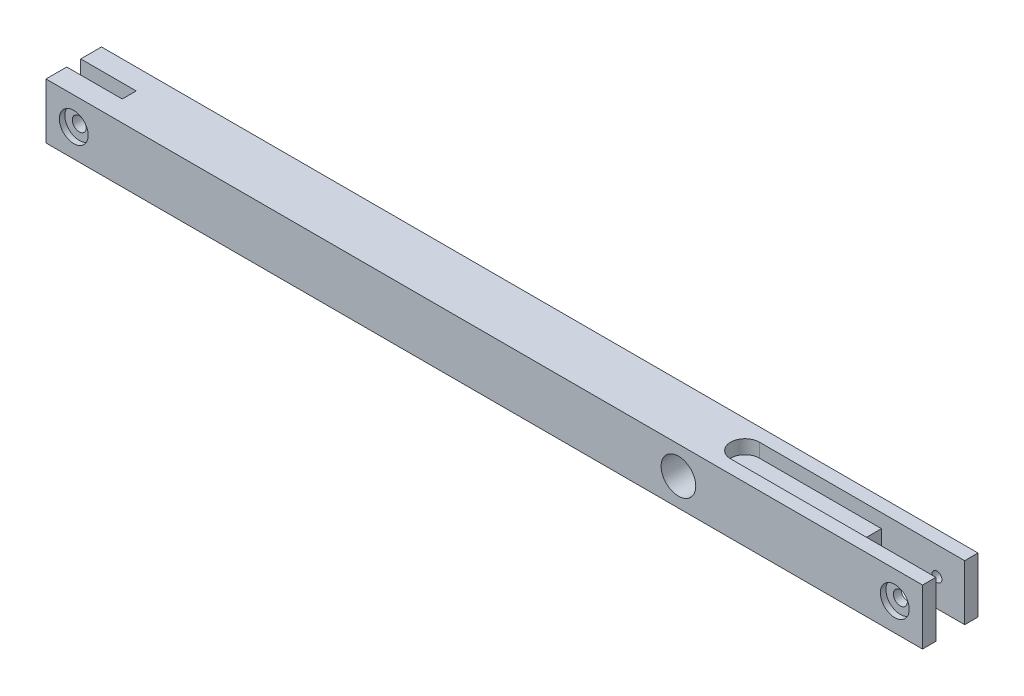
ISO-10303-21;
HEADER;
FILE_DESCRIPTION(('STEP AP214'),'2;1');
FILE_NAME('part.step','',(''),(''),'','','');
FILE_SCHEMA(('AUTOMOTIVE_DESIGN { 1 0 10303 214 1 1 1 1 }'));
ENDSEC;
DATA;
#1=APPLICATION_CONTEXT('core data for automotive mechanical design processes');
#2=APPLICATION_PROTOCOL_DEFINITION('international standard','automotive_design',2000,#1);
#3=PRODUCT_CONTEXT('',#1,'mechanical');
#4=PRODUCT('Part','Part','',(#3));
#5=PRODUCT_RELATED_PRODUCT_CATEGORY('part','',(#4));
#6=PRODUCT_DEFINITION_FORMATION('','',#4);
#7=PRODUCT_DEFINITION_CONTEXT('part definition',#1,'design');
#8=PRODUCT_DEFINITION('design','',#6,#7);
#9=PRODUCT_DEFINITION_SHAPE('','',#8);
#10=(LENGTH_UNIT() NAMED_UNIT(*) SI_UNIT(.MILLI.,.METRE.));
#11=(NAMED_UNIT(*) PLANE_ANGLE_UNIT() SI_UNIT($,.RADIAN.));
#12=(NAMED_UNIT(*) SI_UNIT($,.STERADIAN.) SOLID_ANGLE_UNIT());
#13=UNCERTAINTY_MEASURE_WITH_UNIT(LENGTH_MEASURE(1.E-05),#10,'distance_accuracy_value','');
#14=(GEOMETRIC_REPRESENTATION_CONTEXT(3) GLOBAL_UNCERTAINTY_ASSIGNED_CONTEXT((#13)) GLOBAL_UNIT_ASSIGNED_CONTEXT((#10,
#11,#12)) REPRESENTATION_CONTEXT('',''));
#15=CARTESIAN_POINT('',(0.,0.,0.));
#16=DIRECTION('',(0.,0.,1.));
#17=DIRECTION('',(1.,0.,0.));
#18=AXIS2_PLACEMENT_3D('',#15,#16,#17);
#19=CARTESIAN_POINT('',(36.83,0.,0.));
#20=DIRECTION('',(1.,0.,0.));
#21=DIRECTION('',(0.,0.,-1.));
#22=AXIS2_PLACEMENT_3D('',#19,#20,#21);
#23=PLANE('',#22);
#24=DIRECTION('',(0.,1.,0.));
#25=VECTOR('',#24,1.);
#26=CARTESIAN_POINT('',(36.83,6.35,-3.302));
#27=LINE('',#26,#25);
#28=CARTESIAN_POINT('',(36.83,-6.35,-3.302));
#29=VERTEX_POINT('',#28);
#30=CARTESIAN_POINT('',(36.83,3.175,-3.302));
#31=VERTEX_POINT('',#30);
#32=EDGE_CURVE('E162',#29,#31,#27,.T.);
#33=ORIENTED_EDGE('',*,*,#32,.T.);
#34=DIRECTION('',(0.,0.,1.));
#35=VECTOR('',#34,1.);
#36=CARTESIAN_POINT('',(36.83,3.175,0.));
#37=LINE('',#36,#35);
#38=CARTESIAN_POINT('',(36.83,3.175,3.302));
#39=VERTEX_POINT('',#38);
#40=EDGE_CURVE('E11',#31,#39,#37,.T.);
#41=ORIENTED_EDGE('',*,*,#40,.T.);
#42=DIRECTION('',(0.,-1.,0.));
#43=VECTOR('',#42,1.);
#44=CARTESIAN_POINT('',(36.83,6.35,3.302));
#45=LINE('',#44,#43);
#46=CARTESIAN_POINT('',(36.83,-6.35,3.302));
#47=VERTEX_POINT('',#46);
#48=EDGE_CURVE('E174',#39,#47,#45,.T.);
#49=ORIENTED_EDGE('',*,*,#48,.T.);
#50=DIRECTION('',(0.,0.,-1.));
#51=VECTOR('',#50,1.);
#52=CARTESIAN_POINT('',(36.83,-6.35,3.302));
#53=LINE('',#52,#51);
#54=EDGE_CURVE('E172',#47,#29,#53,.T.);
#55=ORIENTED_EDGE('',*,*,#54,.T.);
#56=EDGE_LOOP('',(#33,#41,#49,#55));
#57=FACE_BOUND('',#56,.T.);
#58=ADVANCED_FACE('F53',(#57),#23,.T.);
#59=CARTESIAN_POINT('',(-144.78,0.,0.));
#60=DIRECTION('',(1.,0.,0.));
#61=DIRECTION('',(0.,0.,-1.));
#62=AXIS2_PLACEMENT_3D('',#59,#60,#61);
#63=PLANE('',#62);
#64=DIRECTION('',(0.,0.,1.));
#65=VECTOR('',#64,1.);
#66=CARTESIAN_POINT('',(-144.78,6.35,6.35));
#67=LINE('',#66,#65);
#68=CARTESIAN_POINT('',(-144.78,6.35,1.6002));
#69=VERTEX_POINT('',#68);
#70=CARTESIAN_POINT('',(-144.78,6.35,6.35));
#71=VERTEX_POINT('',#70);
#72=EDGE_CURVE('E225',#69,#71,#67,.T.);
#73=ORIENTED_EDGE('',*,*,#72,.F.);
#74=DIRECTION('',(0.,1.,0.));
#75=VECTOR('',#74,1.);
#76=CARTESIAN_POINT('',(-144.78,6.35,1.6002));
#77=LINE('',#76,#75);
#78=CARTESIAN_POINT('',(-144.78,-6.35,1.6002));
#79=VERTEX_POINT('',#78);
#80=EDGE_CURVE('E255',#79,#69,#77,.T.);
#81=ORIENTED_EDGE('',*,*,#80,.F.);
#82=DIRECTION('',(0.,0.,-1.));
#83=VECTOR('',#82,1.);
#84=CARTESIAN_POINT('',(-144.78,-6.35,6.35));
#85=LINE('',#84,#83);
#86=CARTESIAN_POINT('',(-144.78,-6.35,6.35));
#87=VERTEX_POINT('',#86);
#88=EDGE_CURVE('E233',#87,#79,#85,.T.);
#89=ORIENTED_EDGE('',*,*,#88,.F.);
#90=DIRECTION('',(0.,-1.,0.));
#91=VECTOR('',#90,1.);
#92=CARTESIAN_POINT('',(-144.78,6.35,6.35));
#93=LINE('',#92,#91);
#94=EDGE_CURVE('E229',#71,#87,#93,.T.);
#95=ORIENTED_EDGE('',*,*,#94,.F.);
#96=EDGE_LOOP('',(#73,#81,#89,#95));
#97=FACE_BOUND('',#96,.T.);
#98=ADVANCED_FACE('F309',(#97),#63,.F.);
#99=CARTESIAN_POINT('',(55.88,0.,0.));
#100=DIRECTION('',(1.,0.,0.));
#101=DIRECTION('',(0.,0.,-1.));
#102=AXIS2_PLACEMENT_3D('',#99,#100,#101);
#103=PLANE('',#102);
#104=DIRECTION('',(0.,1.,0.));
#105=VECTOR('',#104,1.);
#106=CARTESIAN_POINT('',(55.88,6.35,-3.302));
#107=LINE('',#106,#105);
#108=CARTESIAN_POINT('',(55.88,-6.35,-3.302));
#109=VERTEX_POINT('',#108);
#110=CARTESIAN_POINT('',(55.88,6.35,-3.302));
#111=VERTEX_POINT('',#110);
#112=EDGE_CURVE('E179',#109,#111,#107,.T.);
#113=ORIENTED_EDGE('',*,*,#112,.F.);
#114=DIRECTION('',(0.,0.,-1.));
#115=VECTOR('',#114,1.);
#116=CARTESIAN_POINT('',(55.88,-6.35,6.35));
#117=LINE('',#116,#115);
#118=CARTESIAN_POINT('',(55.88,-6.35,-6.35));
#119=VERTEX_POINT('',#118);
#120=EDGE_CURVE('E218',#109,#119,#117,.T.);
#121=ORIENTED_EDGE('',*,*,#120,.T.);
#122=DIRECTION('',(0.,1.,0.));
#123=VECTOR('',#122,1.);
#124=CARTESIAN_POINT('',(55.88,6.35,-6.35));
#125=LINE('',#124,#123);
#126=CARTESIAN_POINT('',(55.88,6.35,-6.35));
#127=VERTEX_POINT('',#126);
#128=EDGE_CURVE('E208',#119,#127,#125,.T.);
#129=ORIENTED_EDGE('',*,*,#128,.T.);
#130=DIRECTION('',(0.,0.,1.));
#131=VECTOR('',#130,1.);
#132=CARTESIAN_POINT('',(55.88,6.35,6.35));
#133=LINE('',#132,#131);
#134=EDGE_CURVE('E212',#127,#111,#133,.T.);
#135=ORIENTED_EDGE('',*,*,#134,.T.);
#136=EDGE_LOOP('',(#113,#121,#129,#135));
#137=FACE_BOUND('',#136,.T.);
#138=ADVANCED_FACE('F330',(#137),#103,.T.);
#139=CARTESIAN_POINT('',(-144.78,6.35,-6.35));
#140=DIRECTION('',(0.,0.,-1.));
#141=DIRECTION('',(0.,1.,0.));
#142=AXIS2_PLACEMENT_3D('',#139,#140,#141);
#143=PLANE('',#142);
#144=CARTESIAN_POINT('',(49.53,0.,-6.35));
#145=DIRECTION('',(0.,0.,1.));
#146=DIRECTION('',(1.,0.,0.));
#147=AXIS2_PLACEMENT_3D('',#144,#145,#146);
#148=CIRCLE('',#147,1.1303);
#149=CARTESIAN_POINT('',(50.6603,0.,-6.35));
#150=VERTEX_POINT('',#149);
#151=EDGE_CURVE('E341',#150,#150,#148,.T.);
#152=ORIENTED_EDGE('',*,*,#151,.T.);
#153=EDGE_LOOP('',(#152));
#154=FACE_BOUND('',#153,.T.);
#155=CARTESIAN_POINT('',(-138.43,0.,-6.35));
#156=DIRECTION('',(0.,0.,1.));
#157=DIRECTION('',(1.,0.,0.));
#158=AXIS2_PLACEMENT_3D('',#155,#156,#157);
#159=CIRCLE('',#158,1.1303);
#160=CARTESIAN_POINT('',(-137.2997,0.,-6.35));
#161=VERTEX_POINT('',#160);
#162=EDGE_CURVE('E262',#161,#161,#159,.T.);
#163=ORIENTED_EDGE('',*,*,#162,.T.);
#164=EDGE_LOOP('',(#163));
#165=FACE_BOUND('',#164,.T.);
#166=CARTESIAN_POINT('',(0.,0.,-6.35));
#167=DIRECTION('',(0.,0.,1.));
#168=DIRECTION('',(1.,0.,0.));
#169=AXIS2_PLACEMENT_3D('',#166,#167,#168);
#170=CIRCLE('',#169,3.96875);
#171=CARTESIAN_POINT('',(3.96875,0.,-6.35));
#172=VERTEX_POINT('',#171);
#173=EDGE_CURVE('E204',#172,#172,#170,.T.);
#174=ORIENTED_EDGE('',*,*,#173,.T.);
#175=EDGE_LOOP('',(#174));
#176=FACE_BOUND('',#175,.T.);
#177=DIRECTION('',(1.,0.,0.));
#178=VECTOR('',#177,1.);
#179=CARTESIAN_POINT('',(-144.78,6.35,-6.35));
#180=LINE('',#179,#178);
#181=CARTESIAN_POINT('',(-144.78,6.35,-6.35));
#182=VERTEX_POINT('',#181);
#183=EDGE_CURVE('E236',#182,#127,#180,.T.);
#184=ORIENTED_EDGE('',*,*,#183,.T.);
#185=ORIENTED_EDGE('',*,*,#128,.F.);
#186=DIRECTION('',(1.,0.,0.));
#187=VECTOR('',#186,1.);
#188=CARTESIAN_POINT('',(-144.78,-6.35,-6.35));
#189=LINE('',#188,#187);
#190=CARTESIAN_POINT('',(-144.78,-6.35,-6.35));
#191=VERTEX_POINT('',#190);
#192=EDGE_CURVE('E61',#191,#119,#189,.T.);
#193=ORIENTED_EDGE('',*,*,#192,.F.);
#194=DIRECTION('',(0.,1.,0.));
#195=VECTOR('',#194,1.);
#196=CARTESIAN_POINT('',(-144.78,6.35,-6.35));
#197=LINE('',#196,#195);
#198=EDGE_CURVE('E222',#191,#182,#197,.T.);
#199=ORIENTED_EDGE('',*,*,#198,.T.);
#200=EDGE_LOOP('',(#184,#185,#193,#199));
#201=FACE_BOUND('',#200,.T.);
#202=ADVANCED_FACE('F55',(#154,#165,#176,#201),#143,.T.);
#203=CARTESIAN_POINT('',(-144.78,-6.35,6.35));
#204=DIRECTION('',(0.,-1.,0.));
#205=DIRECTION('',(0.,0.,-1.));
#206=AXIS2_PLACEMENT_3D('',#203,#204,#205);
#207=PLANE('',#206);
#208=DIRECTION('',(-1.,0.,0.));
#209=VECTOR('',#208,1.);
#210=CARTESIAN_POINT('',(-132.08,-6.35,1.6002));
#211=LINE('',#210,#209);
#212=CARTESIAN_POINT('',(-132.08,-6.35,1.6002));
#213=VERTEX_POINT('',#212);
#214=EDGE_CURVE('E188',#213,#79,#211,.T.);
#215=ORIENTED_EDGE('',*,*,#214,.F.);
#216=DIRECTION('',(0.,0.,1.));
#217=VECTOR('',#216,1.);
#218=CARTESIAN_POINT('',(-132.08,-6.35,-1.6002));
#219=LINE('',#218,#217);
#220=CARTESIAN_POINT('',(-132.08,-6.35,-1.6002));
#221=VERTEX_POINT('',#220);
#222=EDGE_CURVE('E291',#221,#213,#219,.T.);
#223=ORIENTED_EDGE('',*,*,#222,.F.);
#224=DIRECTION('',(-1.,0.,0.));
#225=VECTOR('',#224,1.);
#226=CARTESIAN_POINT('',(-132.08,-6.35,-1.6002));
#227=LINE('',#226,#225);
#228=CARTESIAN_POINT('',(-144.78,-6.35,-1.6002));
#229=VERTEX_POINT('',#228);
#230=EDGE_CURVE('E297',#221,#229,#227,.T.);
#231=ORIENTED_EDGE('',*,*,#230,.T.);
#232=EDGE_CURVE('E232',#229,#191,#85,.T.);
#233=ORIENTED_EDGE('',*,*,#232,.T.);
#234=ORIENTED_EDGE('',*,*,#192,.T.);
#235=ORIENTED_EDGE('',*,*,#120,.F.);
#236=DIRECTION('',(1.,0.,0.));
#237=VECTOR('',#236,1.);
#238=CARTESIAN_POINT('',(36.83,-6.35,-3.302));
#239=LINE('',#238,#237);
#240=EDGE_CURVE('E190',#29,#109,#239,.T.);
#241=ORIENTED_EDGE('',*,*,#240,.F.);
#242=ORIENTED_EDGE('',*,*,#54,.F.);
#243=DIRECTION('',(1.,0.,0.));
#244=VECTOR('',#243,1.);
#245=CARTESIAN_POINT('',(36.83,-6.35,3.302));
#246=LINE('',#245,#244);
#247=CARTESIAN_POINT('',(55.88,-6.35,3.302));
#248=VERTEX_POINT('',#247);
#249=EDGE_CURVE('E193',#47,#248,#246,.T.);
#250=ORIENTED_EDGE('',*,*,#249,.T.);
#251=CARTESIAN_POINT('',(55.88,-6.35,6.35));
#252=VERTEX_POINT('',#251);
#253=EDGE_CURVE('E219',#252,#248,#117,.T.);
#254=ORIENTED_EDGE('',*,*,#253,.F.);
#255=DIRECTION('',(1.,0.,0.));
#256=VECTOR('',#255,1.);
#257=CARTESIAN_POINT('',(-144.78,-6.35,6.35));
#258=LINE('',#257,#256);
#259=EDGE_CURVE('E240',#87,#252,#258,.T.);
#260=ORIENTED_EDGE('',*,*,#259,.F.);
#261=ORIENTED_EDGE('',*,*,#88,.T.);
#262=EDGE_LOOP('',(#215,#223,#231,#233,#234,#235,#241,#242,#250,#254,#260,#261));
#263=FACE_BOUND('',#262,.T.);
#264=ADVANCED_FACE('F326',(#263),#207,.T.);
#265=CARTESIAN_POINT('',(-144.78,6.35,6.35));
#266=DIRECTION('',(0.,0.,1.));
#267=DIRECTION('',(0.,-1.,0.));
#268=AXIS2_PLACEMENT_3D('',#265,#266,#267);
#269=PLANE('',#268);
#270=CARTESIAN_POINT('',(49.53,0.,6.35));
#271=DIRECTION('',(0.,0.,1.));
#272=DIRECTION('',(1.,0.,0.));
#273=AXIS2_PLACEMENT_3D('',#270,#271,#272);
#274=CIRCLE('',#273,3.302);
#275=CARTESIAN_POINT('',(52.832,0.,6.35));
#276=VERTEX_POINT('',#275);
#277=EDGE_CURVE('E259',#276,#276,#274,.T.);
#278=ORIENTED_EDGE('',*,*,#277,.F.);
#279=EDGE_LOOP('',(#278));
#280=FACE_BOUND('',#279,.T.);
#281=CARTESIAN_POINT('',(-138.43,0.,6.35));
#282=DIRECTION('',(0.,0.,1.));
#283=DIRECTION('',(1.,0.,0.));
#284=AXIS2_PLACEMENT_3D('',#281,#282,#283);
#285=CIRCLE('',#284,3.302);
#286=CARTESIAN_POINT('',(-135.128,0.,6.35));
#287=VERTEX_POINT('',#286);
#288=EDGE_CURVE('E252',#287,#287,#285,.T.);
#289=ORIENTED_EDGE('',*,*,#288,.F.);
#290=EDGE_LOOP('',(#289));
#291=FACE_BOUND('',#290,.T.);
#292=CARTESIAN_POINT('',(0.,0.,6.35));
#293=DIRECTION('',(0.,0.,1.));
#294=DIRECTION('',(1.,0.,0.));
#295=AXIS2_PLACEMENT_3D('',#292,#293,#294);
#296=CIRCLE('',#295,3.96874999999999);
#297=CARTESIAN_POINT('',(3.96874999999999,0.,6.35));
#298=VERTEX_POINT('',#297);
#299=EDGE_CURVE('E192',#298,#298,#296,.T.);
#300=ORIENTED_EDGE('',*,*,#299,.F.);
#301=EDGE_LOOP('',(#300));
#302=FACE_BOUND('',#301,.T.);
#303=ORIENTED_EDGE('',*,*,#259,.T.);
#304=DIRECTION('',(0.,-1.,0.));
#305=VECTOR('',#304,1.);
#306=CARTESIAN_POINT('',(55.88,6.35,6.35));
#307=LINE('',#306,#305);
#308=CARTESIAN_POINT('',(55.88,6.35,6.35));
#309=VERTEX_POINT('',#308);
#310=EDGE_CURVE('E215',#309,#252,#307,.T.);
#311=ORIENTED_EDGE('',*,*,#310,.F.);
#312=DIRECTION('',(1.,0.,0.));
#313=VECTOR('',#312,1.);
#314=CARTESIAN_POINT('',(-144.78,6.35,6.35));
#315=LINE('',#314,#313);
#316=EDGE_CURVE('E242',#71,#309,#315,.T.);
#317=ORIENTED_EDGE('',*,*,#316,.F.);
#318=ORIENTED_EDGE('',*,*,#94,.T.);
#319=EDGE_LOOP('',(#303,#311,#317,#318));
#320=FACE_BOUND('',#319,.T.);
#321=ADVANCED_FACE('F312',(#280,#291,#302,#320),#269,.T.);
#322=CARTESIAN_POINT('',(-144.78,6.35,6.35));
#323=DIRECTION('',(0.,1.,0.));
#324=DIRECTION('',(0.,0.,1.));
#325=AXIS2_PLACEMENT_3D('',#322,#323,#324);
#326=PLANE('',#325);
#327=DIRECTION('',(1.,0.,0.));
#328=VECTOR('',#327,1.);
#329=CARTESIAN_POINT('',(36.83,6.35,3.302));
#330=LINE('',#329,#328);
#331=CARTESIAN_POINT('',(8.89,6.35,3.302));
#332=VERTEX_POINT('',#331);
#333=CARTESIAN_POINT('',(55.88,6.35,3.302));
#334=VERTEX_POINT('',#333);
#335=EDGE_CURVE('E196',#332,#334,#330,.T.);
#336=ORIENTED_EDGE('',*,*,#335,.F.);
#337=CARTESIAN_POINT('',(8.89,6.35,0.));
#338=DIRECTION('',(0.,1.,0.));
#339=DIRECTION('',(0.,0.,1.));
#340=AXIS2_PLACEMENT_3D('',#337,#338,#339);
#341=CIRCLE('',#340,3.302);
#342=CARTESIAN_POINT('',(8.89,6.35,-3.302));
#343=VERTEX_POINT('',#342);
#344=EDGE_CURVE('E169',#343,#332,#341,.T.);
#345=ORIENTED_EDGE('',*,*,#344,.F.);
#346=DIRECTION('',(1.,0.,0.));
#347=VECTOR('',#346,1.);
#348=CARTESIAN_POINT('',(36.83,6.35,-3.302));
#349=LINE('',#348,#347);
#350=EDGE_CURVE('E186',#343,#111,#349,.T.);
#351=ORIENTED_EDGE('',*,*,#350,.T.);
#352=ORIENTED_EDGE('',*,*,#134,.F.);
#353=ORIENTED_EDGE('',*,*,#183,.F.);
#354=CARTESIAN_POINT('',(-144.78,6.35,-1.6002));
#355=VERTEX_POINT('',#354);
#356=EDGE_CURVE('E226',#182,#355,#67,.T.);
#357=ORIENTED_EDGE('',*,*,#356,.T.);
#358=DIRECTION('',(-1.,0.,0.));
#359=VECTOR('',#358,1.);
#360=CARTESIAN_POINT('',(-132.08,6.35,-1.6002));
#361=LINE('',#360,#359);
#362=CARTESIAN_POINT('',(-132.08,6.35,-1.6002));
#363=VERTEX_POINT('',#362);
#364=EDGE_CURVE('E75',#363,#355,#361,.T.);
#365=ORIENTED_EDGE('',*,*,#364,.F.);
#366=DIRECTION('',(0.,0.,-1.));
#367=VECTOR('',#366,1.);
#368=CARTESIAN_POINT('',(-132.08,6.35,-1.6002));
#369=LINE('',#368,#367);
#370=CARTESIAN_POINT('',(-132.08,6.35,1.6002));
#371=VERTEX_POINT('',#370);
#372=EDGE_CURVE('E284',#371,#363,#369,.T.);
#373=ORIENTED_EDGE('',*,*,#372,.F.);
#374=DIRECTION('',(-1.,0.,0.));
#375=VECTOR('',#374,1.);
#376=CARTESIAN_POINT('',(-132.08,6.35,1.6002));
#377=LINE('',#376,#375);
#378=EDGE_CURVE('E182',#371,#69,#377,.T.);
#379=ORIENTED_EDGE('',*,*,#378,.T.);
#380=ORIENTED_EDGE('',*,*,#72,.T.);
#381=ORIENTED_EDGE('',*,*,#316,.T.);
#382=EDGE_CURVE('E211',#334,#309,#133,.T.);
#383=ORIENTED_EDGE('',*,*,#382,.F.);
#384=EDGE_LOOP('',(#336,#345,#351,#352,#353,#357,#365,#373,#379,#380,#381,#383));
#385=FACE_BOUND('',#384,.T.);
#386=ADVANCED_FACE('F303',(#385),#326,.T.);
#387=ORIENTED_EDGE('',*,*,#232,.F.);
#388=DIRECTION('',(0.,-1.,0.));
#389=VECTOR('',#388,1.);
#390=CARTESIAN_POINT('',(-144.78,6.35,-1.6002));
#391=LINE('',#390,#389);
#392=EDGE_CURVE('E285',#355,#229,#391,.T.);
#393=ORIENTED_EDGE('',*,*,#392,.F.);
#394=ORIENTED_EDGE('',*,*,#356,.F.);
#395=ORIENTED_EDGE('',*,*,#198,.F.);
#396=EDGE_LOOP('',(#387,#393,#394,#395));
#397=FACE_BOUND('',#396,.T.);
#398=ADVANCED_FACE('F376',(#397),#63,.F.);
#399=DIRECTION('',(0.,-1.,0.));
#400=VECTOR('',#399,1.);
#401=CARTESIAN_POINT('',(55.88,6.35,3.302));
#402=LINE('',#401,#400);
#403=EDGE_CURVE('E175',#334,#248,#402,.T.);
#404=ORIENTED_EDGE('',*,*,#403,.F.);
#405=ORIENTED_EDGE('',*,*,#382,.T.);
#406=ORIENTED_EDGE('',*,*,#310,.T.);
#407=ORIENTED_EDGE('',*,*,#253,.T.);
#408=EDGE_LOOP('',(#404,#405,#406,#407));
#409=FACE_BOUND('',#408,.T.);
#410=ADVANCED_FACE('F319',(#409),#103,.T.);
#411=CARTESIAN_POINT('',(0.,0.,6.35));
#412=DIRECTION('',(0.,0.,1.));
#413=DIRECTION('',(1.,0.,0.));
#414=AXIS2_PLACEMENT_3D('',#411,#412,#413);
#415=CYLINDRICAL_SURFACE('',#414,3.96874999999999);
#416=ORIENTED_EDGE('',*,*,#173,.F.);
#417=EDGE_LOOP('',(#416));
#418=FACE_BOUND('',#417,.T.);
#419=ORIENTED_EDGE('',*,*,#299,.T.);
#420=EDGE_LOOP('',(#419));
#421=FACE_BOUND('',#420,.T.);
#422=ADVANCED_FACE('F367',(#418,#421),#415,.F.);
#423=CARTESIAN_POINT('',(36.83,6.35,-3.302));
#424=DIRECTION('',(0.,0.,-1.));
#425=DIRECTION('',(0.,1.,0.));
#426=AXIS2_PLACEMENT_3D('',#423,#424,#425);
#427=PLANE('',#426);
#428=CARTESIAN_POINT('',(49.53,0.,-3.302));
#429=DIRECTION('',(0.,0.,-1.));
#430=DIRECTION('',(0.,1.,0.));
#431=AXIS2_PLACEMENT_3D('',#428,#429,#430);
#432=CIRCLE('',#431,1.1303);
#433=CARTESIAN_POINT('',(49.53,1.1303,-3.302));
#434=VERTEX_POINT('',#433);
#435=EDGE_CURVE('E258',#434,#434,#432,.T.);
#436=ORIENTED_EDGE('',*,*,#435,.T.);
#437=EDGE_LOOP('',(#436));
#438=FACE_BOUND('',#437,.T.);
#439=ORIENTED_EDGE('',*,*,#112,.T.);
#440=ORIENTED_EDGE('',*,*,#350,.F.);
#441=DIRECTION('',(0.,1.,0.));
#442=VECTOR('',#441,1.);
#443=CARTESIAN_POINT('',(8.89,3.175,-3.302));
#444=LINE('',#443,#442);
#445=CARTESIAN_POINT('',(8.89,3.175,-3.302));
#446=VERTEX_POINT('',#445);
#447=EDGE_CURVE('E165',#446,#343,#444,.T.);
#448=ORIENTED_EDGE('',*,*,#447,.F.);
#449=DIRECTION('',(-1.,0.,0.));
#450=VECTOR('',#449,1.);
#451=CARTESIAN_POINT('',(36.83,3.175,-3.302));
#452=LINE('',#451,#450);
#453=EDGE_CURVE('E156',#31,#446,#452,.T.);
#454=ORIENTED_EDGE('',*,*,#453,.F.);
#455=ORIENTED_EDGE('',*,*,#32,.F.);
#456=ORIENTED_EDGE('',*,*,#240,.T.);
#457=EDGE_LOOP('',(#439,#440,#448,#454,#455,#456));
#458=FACE_BOUND('',#457,.T.);
#459=ADVANCED_FACE('F161',(#438,#458),#427,.F.);
#460=CARTESIAN_POINT('',(36.83,6.35,3.302));
#461=DIRECTION('',(0.,0.,1.));
#462=DIRECTION('',(1.,0.,0.));
#463=AXIS2_PLACEMENT_3D('',#460,#461,#462);
#464=PLANE('',#463);
#465=CARTESIAN_POINT('',(49.53,0.,3.302));
#466=DIRECTION('',(0.,0.,1.));
#467=DIRECTION('',(1.,0.,0.));
#468=AXIS2_PLACEMENT_3D('',#465,#466,#467);
#469=CIRCLE('',#468,1.6002);
#470=CARTESIAN_POINT('',(51.1302,0.,3.302));
#471=VERTEX_POINT('',#470);
#472=EDGE_CURVE('E256',#471,#471,#469,.T.);
#473=ORIENTED_EDGE('',*,*,#472,.T.);
#474=EDGE_LOOP('',(#473));
#475=FACE_BOUND('',#474,.T.);
#476=ORIENTED_EDGE('',*,*,#403,.T.);
#477=ORIENTED_EDGE('',*,*,#249,.F.);
#478=ORIENTED_EDGE('',*,*,#48,.F.);
#479=DIRECTION('',(1.,0.,0.));
#480=VECTOR('',#479,1.);
#481=CARTESIAN_POINT('',(36.83,3.175,3.302));
#482=LINE('',#481,#480);
#483=CARTESIAN_POINT('',(8.89,3.175,3.302));
#484=VERTEX_POINT('',#483);
#485=EDGE_CURVE('E68',#484,#39,#482,.T.);
#486=ORIENTED_EDGE('',*,*,#485,.F.);
#487=DIRECTION('',(0.,1.,0.));
#488=VECTOR('',#487,1.);
#489=CARTESIAN_POINT('',(8.89,3.175,3.302));
#490=LINE('',#489,#488);
#491=EDGE_CURVE('E338',#484,#332,#490,.T.);
#492=ORIENTED_EDGE('',*,*,#491,.T.);
#493=ORIENTED_EDGE('',*,*,#335,.T.);
#494=EDGE_LOOP('',(#476,#477,#478,#486,#492,#493));
#495=FACE_BOUND('',#494,.T.);
#496=ADVANCED_FACE('F323',(#475,#495),#464,.F.);
#497=CARTESIAN_POINT('',(-132.08,6.35,1.6002));
#498=DIRECTION('',(0.,0.,1.));
#499=DIRECTION('',(1.,0.,0.));
#500=AXIS2_PLACEMENT_3D('',#497,#498,#499);
#501=PLANE('',#500);
#502=CARTESIAN_POINT('',(-138.43,0.,1.6002));
#503=DIRECTION('',(0.,0.,1.));
#504=DIRECTION('',(1.,0.,0.));
#505=AXIS2_PLACEMENT_3D('',#502,#503,#504);
#506=CIRCLE('',#505,1.6002);
#507=CARTESIAN_POINT('',(-136.8298,0.,1.6002));
#508=VERTEX_POINT('',#507);
#509=EDGE_CURVE('E251',#508,#508,#506,.T.);
#510=ORIENTED_EDGE('',*,*,#509,.T.);
#511=EDGE_LOOP('',(#510));
#512=FACE_BOUND('',#511,.T.);
#513=ORIENTED_EDGE('',*,*,#80,.T.);
#514=ORIENTED_EDGE('',*,*,#378,.F.);
#515=DIRECTION('',(0.,1.,0.));
#516=VECTOR('',#515,1.);
#517=CARTESIAN_POINT('',(-132.08,6.35,1.6002));
#518=LINE('',#517,#516);
#519=EDGE_CURVE('E281',#213,#371,#518,.T.);
#520=ORIENTED_EDGE('',*,*,#519,.F.);
#521=ORIENTED_EDGE('',*,*,#214,.T.);
#522=EDGE_LOOP('',(#513,#514,#520,#521));
#523=FACE_BOUND('',#522,.T.);
#524=ADVANCED_FACE('F387',(#512,#523),#501,.F.);
#525=CARTESIAN_POINT('',(-132.08,6.35,-1.6002));
#526=DIRECTION('',(0.,0.,-1.));
#527=DIRECTION('',(-1.,0.,0.));
#528=AXIS2_PLACEMENT_3D('',#525,#526,#527);
#529=PLANE('',#528);
#530=CARTESIAN_POINT('',(-138.43,0.,-1.6002));
#531=DIRECTION('',(0.,0.,-1.));
#532=DIRECTION('',(-1.,0.,0.));
#533=AXIS2_PLACEMENT_3D('',#530,#531,#532);
#534=CIRCLE('',#533,1.1303);
#535=CARTESIAN_POINT('',(-139.5603,0.,-1.6002));
#536=VERTEX_POINT('',#535);
#537=EDGE_CURVE('E248',#536,#536,#534,.T.);
#538=ORIENTED_EDGE('',*,*,#537,.T.);
#539=EDGE_LOOP('',(#538));
#540=FACE_BOUND('',#539,.T.);
#541=ORIENTED_EDGE('',*,*,#392,.T.);
#542=ORIENTED_EDGE('',*,*,#230,.F.);
#543=DIRECTION('',(0.,-1.,0.));
#544=VECTOR('',#543,1.);
#545=CARTESIAN_POINT('',(-132.08,6.35,-1.6002));
#546=LINE('',#545,#544);
#547=EDGE_CURVE('E288',#363,#221,#546,.T.);
#548=ORIENTED_EDGE('',*,*,#547,.F.);
#549=ORIENTED_EDGE('',*,*,#364,.T.);
#550=EDGE_LOOP('',(#541,#542,#548,#549));
#551=FACE_BOUND('',#550,.T.);
#552=ADVANCED_FACE('F392',(#540,#551),#529,.F.);
#553=CARTESIAN_POINT('',(-132.08,0.,0.));
#554=DIRECTION('',(-1.,0.,0.));
#555=DIRECTION('',(0.,0.,1.));
#556=AXIS2_PLACEMENT_3D('',#553,#554,#555);
#557=PLANE('',#556);
#558=ORIENTED_EDGE('',*,*,#519,.T.);
#559=ORIENTED_EDGE('',*,*,#372,.T.);
#560=ORIENTED_EDGE('',*,*,#547,.T.);
#561=ORIENTED_EDGE('',*,*,#222,.T.);
#562=EDGE_LOOP('',(#558,#559,#560,#561));
#563=FACE_BOUND('',#562,.T.);
#564=ADVANCED_FACE('F421',(#563),#557,.T.);
#565=CARTESIAN_POINT('',(-138.43,0.,6.35));
#566=DIRECTION('',(0.,0.,1.));
#567=DIRECTION('',(1.,0.,0.));
#568=AXIS2_PLACEMENT_3D('',#565,#566,#567);
#569=CYLINDRICAL_SURFACE('',#568,1.1303);
#570=ORIENTED_EDGE('',*,*,#162,.F.);
#571=EDGE_LOOP('',(#570));
#572=FACE_BOUND('',#571,.T.);
#573=ORIENTED_EDGE('',*,*,#537,.F.);
#574=EDGE_LOOP('',(#573));
#575=FACE_BOUND('',#574,.T.);
#576=ADVANCED_FACE('F417',(#572,#575),#569,.F.);
#577=CARTESIAN_POINT('',(-138.43,0.,6.35));
#578=DIRECTION('',(0.,0.,1.));
#579=DIRECTION('',(1.,0.,0.));
#580=AXIS2_PLACEMENT_3D('',#577,#578,#579);
#581=CYLINDRICAL_SURFACE('',#580,1.6002);
#582=CARTESIAN_POINT('',(-138.43,0.,5.08));
#583=DIRECTION('',(0.,0.,1.));
#584=DIRECTION('',(1.,0.,0.));
#585=AXIS2_PLACEMENT_3D('',#582,#583,#584);
#586=CIRCLE('',#585,1.6002);
#587=CARTESIAN_POINT('',(-136.8298,0.,5.08));
#588=VERTEX_POINT('',#587);
#589=EDGE_CURVE('E267',#588,#588,#586,.T.);
#590=ORIENTED_EDGE('',*,*,#589,.T.);
#591=EDGE_LOOP('',(#590));
#592=FACE_BOUND('',#591,.T.);
#593=ORIENTED_EDGE('',*,*,#509,.F.);
#594=EDGE_LOOP('',(#593));
#595=FACE_BOUND('',#594,.T.);
#596=ADVANCED_FACE('F420',(#592,#595),#581,.F.);
#597=CARTESIAN_POINT('',(-138.43,0.,6.35));
#598=DIRECTION('',(0.,0.,1.));
#599=DIRECTION('',(1.,0.,0.));
#600=AXIS2_PLACEMENT_3D('',#597,#598,#599);
#601=CYLINDRICAL_SURFACE('',#600,3.302);
#602=CARTESIAN_POINT('',(-138.43,0.,5.08));
#603=DIRECTION('',(0.,0.,1.));
#604=DIRECTION('',(1.,0.,0.));
#605=AXIS2_PLACEMENT_3D('',#602,#603,#604);
#606=CIRCLE('',#605,3.302);
#607=CARTESIAN_POINT('',(-135.128,0.,5.08));
#608=VERTEX_POINT('',#607);
#609=EDGE_CURVE('E272',#608,#608,#606,.T.);
#610=ORIENTED_EDGE('',*,*,#609,.F.);
#611=EDGE_LOOP('',(#610));
#612=FACE_BOUND('',#611,.T.);
#613=ORIENTED_EDGE('',*,*,#288,.T.);
#614=EDGE_LOOP('',(#613));
#615=FACE_BOUND('',#614,.T.);
#616=ADVANCED_FACE('F425',(#612,#615),#601,.F.);
#617=CARTESIAN_POINT('',(-135.128,0.,5.08));
#618=DIRECTION('',(0.,0.,-1.));
#619=DIRECTION('',(-1.,0.,0.));
#620=AXIS2_PLACEMENT_3D('',#617,#618,#619);
#621=PLANE('',#620);
#622=ORIENTED_EDGE('',*,*,#589,.F.);
#623=EDGE_LOOP('',(#622));
#624=FACE_BOUND('',#623,.T.);
#625=ORIENTED_EDGE('',*,*,#609,.T.);
#626=EDGE_LOOP('',(#625));
#627=FACE_BOUND('',#626,.T.);
#628=ADVANCED_FACE('F415',(#624,#627),#621,.F.);
#629=CARTESIAN_POINT('',(49.53,0.,6.35));
#630=DIRECTION('',(0.,0.,1.));
#631=DIRECTION('',(1.,0.,0.));
#632=AXIS2_PLACEMENT_3D('',#629,#630,#631);
#633=CYLINDRICAL_SURFACE('',#632,3.302);
#634=CARTESIAN_POINT('',(49.53,0.,5.08));
#635=DIRECTION('',(0.,0.,1.));
#636=DIRECTION('',(1.,0.,0.));
#637=AXIS2_PLACEMENT_3D('',#634,#635,#636);
#638=CIRCLE('',#637,3.302);
#639=CARTESIAN_POINT('',(52.832,0.,5.08));
#640=VERTEX_POINT('',#639);
#641=EDGE_CURVE('E350',#640,#640,#638,.T.);
#642=ORIENTED_EDGE('',*,*,#641,.F.);
#643=EDGE_LOOP('',(#642));
#644=FACE_BOUND('',#643,.T.);
#645=ORIENTED_EDGE('',*,*,#277,.T.);
#646=EDGE_LOOP('',(#645));
#647=FACE_BOUND('',#646,.T.);
#648=ADVANCED_FACE('F358',(#644,#647),#633,.F.);
#649=CARTESIAN_POINT('',(52.832,0.,5.08));
#650=DIRECTION('',(0.,0.,-1.));
#651=DIRECTION('',(-1.,0.,0.));
#652=AXIS2_PLACEMENT_3D('',#649,#650,#651);
#653=PLANE('',#652);
#654=CARTESIAN_POINT('',(49.53,0.,5.08));
#655=DIRECTION('',(0.,0.,1.));
#656=DIRECTION('',(1.,0.,0.));
#657=AXIS2_PLACEMENT_3D('',#654,#655,#656);
#658=CIRCLE('',#657,1.6002);
#659=CARTESIAN_POINT('',(51.1302,0.,5.08));
#660=VERTEX_POINT('',#659);
#661=EDGE_CURVE('E348',#660,#660,#658,.T.);
#662=ORIENTED_EDGE('',*,*,#661,.F.);
#663=EDGE_LOOP('',(#662));
#664=FACE_BOUND('',#663,.T.);
#665=ORIENTED_EDGE('',*,*,#641,.T.);
#666=EDGE_LOOP('',(#665));
#667=FACE_BOUND('',#666,.T.);
#668=ADVANCED_FACE('F399',(#664,#667),#653,.F.);
#669=CARTESIAN_POINT('',(49.53,0.,6.35));
#670=DIRECTION('',(0.,0.,1.));
#671=DIRECTION('',(1.,0.,0.));
#672=AXIS2_PLACEMENT_3D('',#669,#670,#671);
#673=CYLINDRICAL_SURFACE('',#672,1.6002);
#674=ORIENTED_EDGE('',*,*,#661,.T.);
#675=EDGE_LOOP('',(#674));
#676=FACE_BOUND('',#675,.T.);
#677=ORIENTED_EDGE('',*,*,#472,.F.);
#678=EDGE_LOOP('',(#677));
#679=FACE_BOUND('',#678,.T.);
#680=ADVANCED_FACE('F396',(#676,#679),#673,.F.);
#681=CARTESIAN_POINT('',(49.53,0.,6.35));
#682=DIRECTION('',(0.,0.,1.));
#683=DIRECTION('',(1.,0.,0.));
#684=AXIS2_PLACEMENT_3D('',#681,#682,#683);
#685=CYLINDRICAL_SURFACE('',#684,1.1303);
#686=ORIENTED_EDGE('',*,*,#151,.F.);
#687=EDGE_LOOP('',(#686));
#688=FACE_BOUND('',#687,.T.);
#689=ORIENTED_EDGE('',*,*,#435,.F.);
#690=EDGE_LOOP('',(#689));
#691=FACE_BOUND('',#690,.T.);
#692=ADVANCED_FACE('F398',(#688,#691),#685,.F.);
#693=CARTESIAN_POINT('',(8.89,3.175,0.));
#694=DIRECTION('',(0.,1.,0.));
#695=DIRECTION('',(0.,0.,1.));
#696=AXIS2_PLACEMENT_3D('',#693,#694,#695);
#697=CYLINDRICAL_SURFACE('',#696,3.302);
#698=ORIENTED_EDGE('',*,*,#344,.T.);
#699=ORIENTED_EDGE('',*,*,#491,.F.);
#700=CARTESIAN_POINT('',(8.89,3.175,0.));
#701=DIRECTION('',(0.,1.,0.));
#702=DIRECTION('',(0.,0.,1.));
#703=AXIS2_PLACEMENT_3D('',#700,#701,#702);
#704=CIRCLE('',#703,3.302);
#705=EDGE_CURVE('E168',#446,#484,#704,.T.);
#706=ORIENTED_EDGE('',*,*,#705,.F.);
#707=ORIENTED_EDGE('',*,*,#447,.T.);
#708=EDGE_LOOP('',(#698,#699,#706,#707));
#709=FACE_BOUND('',#708,.T.);
#710=ADVANCED_FACE('F336',(#709),#697,.F.);
#711=CARTESIAN_POINT('',(36.83,3.175,0.));
#712=DIRECTION('',(0.,1.,0.));
#713=DIRECTION('',(0.,0.,1.));
#714=AXIS2_PLACEMENT_3D('',#711,#712,#713);
#715=PLANE('',#714);
#716=ORIENTED_EDGE('',*,*,#453,.T.);
#717=ORIENTED_EDGE('',*,*,#705,.T.);
#718=ORIENTED_EDGE('',*,*,#485,.T.);
#719=ORIENTED_EDGE('',*,*,#40,.F.);
#720=EDGE_LOOP('',(#716,#717,#718,#719));
#721=FACE_BOUND('',#720,.T.);
#722=ADVANCED_FACE('F155',(#721),#715,.T.);
#723=CLOSED_SHELL('',(#58,#98,#138,#202,#264,#321,#386,#398,#410,#422,#459,#496,#524,#552,#564,
#576,#596,#616,#628,#648,#668,#680,#692,#710,#722));
#724=MANIFOLD_SOLID_BREP('B2',#723);
#725=ADVANCED_BREP_SHAPE_REPRESENTATION('',(#18,#724),#14);
#726=SHAPE_DEFINITION_REPRESENTATION(#9,#725);
ENDSEC;
END-ISO-10303-21;
